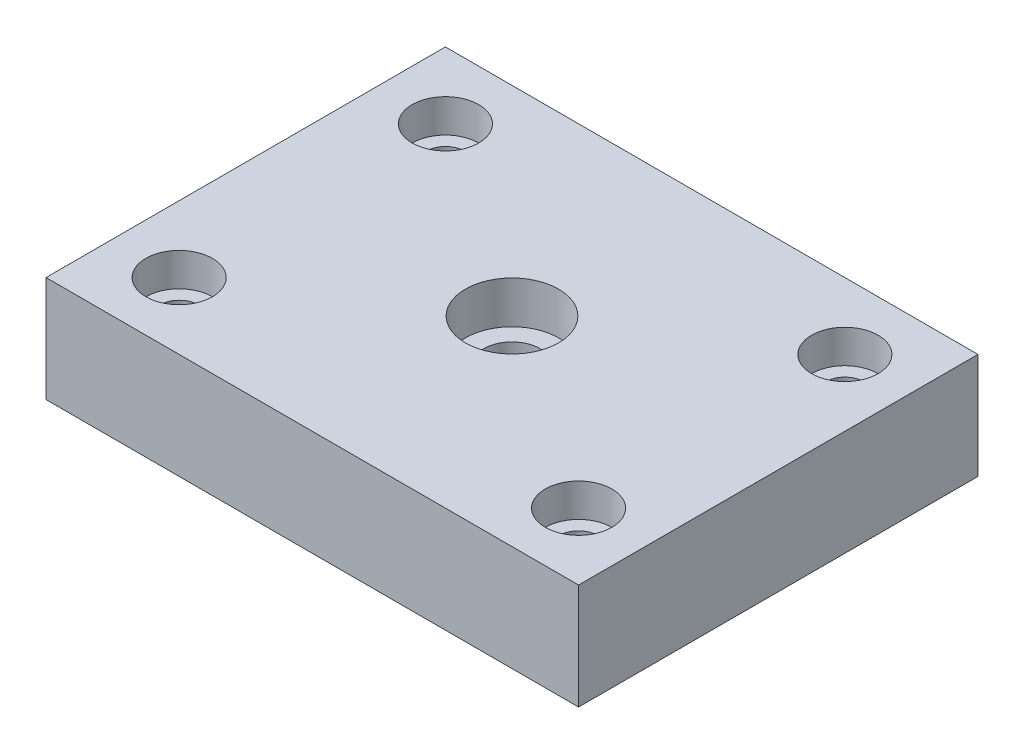
ISO-10303-21;
HEADER;
FILE_DESCRIPTION(('STEP AP214'),'2;1');
FILE_NAME('part.step','',(''),(''),'','','');
FILE_SCHEMA(('AUTOMOTIVE_DESIGN { 1 0 10303 214 1 1 1 1 }'));
ENDSEC;
DATA;
#1=APPLICATION_CONTEXT('core data for automotive mechanical design processes');
#2=APPLICATION_PROTOCOL_DEFINITION('international standard','automotive_design',2000,#1);
#3=PRODUCT_CONTEXT('',#1,'mechanical');
#4=PRODUCT('Part','Part','',(#3));
#5=PRODUCT_RELATED_PRODUCT_CATEGORY('part','',(#4));
#6=PRODUCT_DEFINITION_FORMATION('','',#4);
#7=PRODUCT_DEFINITION_CONTEXT('part definition',#1,'design');
#8=PRODUCT_DEFINITION('design','',#6,#7);
#9=PRODUCT_DEFINITION_SHAPE('','',#8);
#10=(LENGTH_UNIT() NAMED_UNIT(*) SI_UNIT(.MILLI.,.METRE.));
#11=(NAMED_UNIT(*) PLANE_ANGLE_UNIT() SI_UNIT($,.RADIAN.));
#12=(NAMED_UNIT(*) SI_UNIT($,.STERADIAN.) SOLID_ANGLE_UNIT());
#13=UNCERTAINTY_MEASURE_WITH_UNIT(LENGTH_MEASURE(1.E-05),#10,'distance_accuracy_value','');
#14=(GEOMETRIC_REPRESENTATION_CONTEXT(3) GLOBAL_UNCERTAINTY_ASSIGNED_CONTEXT((#13)) GLOBAL_UNIT_ASSIGNED_CONTEXT((#10,
#11,#12)) REPRESENTATION_CONTEXT('',''));
#15=CARTESIAN_POINT('',(0.,0.,0.));
#16=DIRECTION('',(0.,0.,1.));
#17=DIRECTION('',(1.,0.,0.));
#18=AXIS2_PLACEMENT_3D('',#15,#16,#17);
#19=CARTESIAN_POINT('',(40.,-15.875,30.));
#20=DIRECTION('',(1.,0.,0.));
#21=DIRECTION('',(0.,0.,-1.));
#22=AXIS2_PLACEMENT_3D('',#19,#20,#21);
#23=PLANE('',#22);
#24=DIRECTION('',(0.,0.,-1.));
#25=VECTOR('',#24,1.);
#26=CARTESIAN_POINT('',(40.,0.,30.));
#27=LINE('',#26,#25);
#28=CARTESIAN_POINT('',(40.,0.,30.));
#29=VERTEX_POINT('',#28);
#30=CARTESIAN_POINT('',(40.,0.,-30.));
#31=VERTEX_POINT('',#30);
#32=EDGE_CURVE('E103',#29,#31,#27,.T.);
#33=ORIENTED_EDGE('',*,*,#32,.F.);
#34=DIRECTION('',(0.,1.,0.));
#35=VECTOR('',#34,1.);
#36=CARTESIAN_POINT('',(40.,-15.875,30.));
#37=LINE('',#36,#35);
#38=CARTESIAN_POINT('',(40.,-15.875,30.));
#39=VERTEX_POINT('',#38);
#40=EDGE_CURVE('E11',#39,#29,#37,.T.);
#41=ORIENTED_EDGE('',*,*,#40,.F.);
#42=DIRECTION('',(0.,0.,-1.));
#43=VECTOR('',#42,1.);
#44=CARTESIAN_POINT('',(40.,-15.875,30.));
#45=LINE('',#44,#43);
#46=CARTESIAN_POINT('',(40.,-15.875,-30.));
#47=VERTEX_POINT('',#46);
#48=EDGE_CURVE('E96',#39,#47,#45,.T.);
#49=ORIENTED_EDGE('',*,*,#48,.T.);
#50=DIRECTION('',(0.,1.,0.));
#51=VECTOR('',#50,1.);
#52=CARTESIAN_POINT('',(40.,-15.875,-30.));
#53=LINE('',#52,#51);
#54=EDGE_CURVE('E41',#47,#31,#53,.T.);
#55=ORIENTED_EDGE('',*,*,#54,.T.);
#56=EDGE_LOOP('',(#33,#41,#49,#55));
#57=FACE_BOUND('',#56,.T.);
#58=ADVANCED_FACE('F38',(#57),#23,.T.);
#59=CARTESIAN_POINT('',(-40.,-15.875,30.));
#60=DIRECTION('',(0.,0.,1.));
#61=DIRECTION('',(1.,0.,0.));
#62=AXIS2_PLACEMENT_3D('',#59,#60,#61);
#63=PLANE('',#62);
#64=DIRECTION('',(1.,0.,0.));
#65=VECTOR('',#64,1.);
#66=CARTESIAN_POINT('',(-40.,0.,30.));
#67=LINE('',#66,#65);
#68=CARTESIAN_POINT('',(-40.,0.,30.));
#69=VERTEX_POINT('',#68);
#70=EDGE_CURVE('E98',#69,#29,#67,.T.);
#71=ORIENTED_EDGE('',*,*,#70,.F.);
#72=DIRECTION('',(0.,1.,0.));
#73=VECTOR('',#72,1.);
#74=CARTESIAN_POINT('',(-40.,-15.875,30.));
#75=LINE('',#74,#73);
#76=CARTESIAN_POINT('',(-40.,-15.875,30.));
#77=VERTEX_POINT('',#76);
#78=EDGE_CURVE('E47',#77,#69,#75,.T.);
#79=ORIENTED_EDGE('',*,*,#78,.F.);
#80=DIRECTION('',(1.,0.,0.));
#81=VECTOR('',#80,1.);
#82=CARTESIAN_POINT('',(-40.,-15.875,30.));
#83=LINE('',#82,#81);
#84=EDGE_CURVE('E93',#77,#39,#83,.T.);
#85=ORIENTED_EDGE('',*,*,#84,.T.);
#86=ORIENTED_EDGE('',*,*,#40,.T.);
#87=EDGE_LOOP('',(#71,#79,#85,#86));
#88=FACE_BOUND('',#87,.T.);
#89=ADVANCED_FACE('F114',(#88),#63,.T.);
#90=CARTESIAN_POINT('',(-40.,-15.875,30.));
#91=DIRECTION('',(-1.,0.,0.));
#92=DIRECTION('',(0.,0.,1.));
#93=AXIS2_PLACEMENT_3D('',#90,#91,#92);
#94=PLANE('',#93);
#95=DIRECTION('',(0.,0.,1.));
#96=VECTOR('',#95,1.);
#97=CARTESIAN_POINT('',(-40.,0.,30.));
#98=LINE('',#97,#96);
#99=CARTESIAN_POINT('',(-40.,0.,-30.));
#100=VERTEX_POINT('',#99);
#101=EDGE_CURVE('E88',#100,#69,#98,.T.);
#102=ORIENTED_EDGE('',*,*,#101,.F.);
#103=DIRECTION('',(0.,1.,0.));
#104=VECTOR('',#103,1.);
#105=CARTESIAN_POINT('',(-40.,-15.875,-30.));
#106=LINE('',#105,#104);
#107=CARTESIAN_POINT('',(-40.,-15.875,-30.));
#108=VERTEX_POINT('',#107);
#109=EDGE_CURVE('E83',#108,#100,#106,.T.);
#110=ORIENTED_EDGE('',*,*,#109,.F.);
#111=DIRECTION('',(0.,0.,1.));
#112=VECTOR('',#111,1.);
#113=CARTESIAN_POINT('',(-40.,-15.875,30.));
#114=LINE('',#113,#112);
#115=EDGE_CURVE('E86',#108,#77,#114,.T.);
#116=ORIENTED_EDGE('',*,*,#115,.T.);
#117=ORIENTED_EDGE('',*,*,#78,.T.);
#118=EDGE_LOOP('',(#102,#110,#116,#117));
#119=FACE_BOUND('',#118,.T.);
#120=ADVANCED_FACE('F85',(#119),#94,.T.);
#121=CARTESIAN_POINT('',(-40.,-15.875,-30.));
#122=DIRECTION('',(0.,0.,-1.));
#123=DIRECTION('',(-1.,0.,0.));
#124=AXIS2_PLACEMENT_3D('',#121,#122,#123);
#125=PLANE('',#124);
#126=DIRECTION('',(-1.,0.,0.));
#127=VECTOR('',#126,1.);
#128=CARTESIAN_POINT('',(-40.,0.,-30.));
#129=LINE('',#128,#127);
#130=EDGE_CURVE('E106',#31,#100,#129,.T.);
#131=ORIENTED_EDGE('',*,*,#130,.F.);
#132=ORIENTED_EDGE('',*,*,#54,.F.);
#133=DIRECTION('',(-1.,0.,0.));
#134=VECTOR('',#133,1.);
#135=CARTESIAN_POINT('',(-40.,-15.875,-30.));
#136=LINE('',#135,#134);
#137=EDGE_CURVE('E92',#47,#108,#136,.T.);
#138=ORIENTED_EDGE('',*,*,#137,.T.);
#139=ORIENTED_EDGE('',*,*,#109,.T.);
#140=EDGE_LOOP('',(#131,#132,#138,#139));
#141=FACE_BOUND('',#140,.T.);
#142=ADVANCED_FACE('F95',(#141),#125,.T.);
#143=CARTESIAN_POINT('',(0.,-15.875,0.));
#144=DIRECTION('',(0.,-1.,0.));
#145=DIRECTION('',(0.,0.,-1.));
#146=AXIS2_PLACEMENT_3D('',#143,#144,#145);
#147=PLANE('',#146);
#148=CARTESIAN_POINT('',(0.,-15.875,0.));
#149=DIRECTION('',(0.,1.,0.));
#150=DIRECTION('',(0.,0.,1.));
#151=AXIS2_PLACEMENT_3D('',#148,#149,#150);
#152=CIRCLE('',#151,4.2164);
#153=CARTESIAN_POINT('',(0.,-15.875,4.2164));
#154=VERTEX_POINT('',#153);
#155=EDGE_CURVE('E210',#154,#154,#152,.T.);
#156=ORIENTED_EDGE('',*,*,#155,.T.);
#157=EDGE_LOOP('',(#156));
#158=FACE_BOUND('',#157,.T.);
#159=CARTESIAN_POINT('',(-30.,-15.875,20.));
#160=DIRECTION('',(0.,1.,0.));
#161=DIRECTION('',(0.,0.,1.));
#162=AXIS2_PLACEMENT_3D('',#159,#160,#161);
#163=CIRCLE('',#162,2.9);
#164=CARTESIAN_POINT('',(-30.,-15.875,22.9));
#165=VERTEX_POINT('',#164);
#166=EDGE_CURVE('E221',#165,#165,#163,.T.);
#167=ORIENTED_EDGE('',*,*,#166,.T.);
#168=EDGE_LOOP('',(#167));
#169=FACE_BOUND('',#168,.T.);
#170=CARTESIAN_POINT('',(-30.,-15.875,-20.));
#171=DIRECTION('',(0.,1.,0.));
#172=DIRECTION('',(0.,0.,1.));
#173=AXIS2_PLACEMENT_3D('',#170,#171,#172);
#174=CIRCLE('',#173,2.9);
#175=CARTESIAN_POINT('',(-30.,-15.875,-17.1));
#176=VERTEX_POINT('',#175);
#177=EDGE_CURVE('E233',#176,#176,#174,.T.);
#178=ORIENTED_EDGE('',*,*,#177,.T.);
#179=EDGE_LOOP('',(#178));
#180=FACE_BOUND('',#179,.T.);
#181=CARTESIAN_POINT('',(30.,-15.875,-20.));
#182=DIRECTION('',(0.,1.,0.));
#183=DIRECTION('',(0.,0.,1.));
#184=AXIS2_PLACEMENT_3D('',#181,#182,#183);
#185=CIRCLE('',#184,2.89999999999999);
#186=CARTESIAN_POINT('',(30.,-15.875,-17.1));
#187=VERTEX_POINT('',#186);
#188=EDGE_CURVE('E245',#187,#187,#185,.T.);
#189=ORIENTED_EDGE('',*,*,#188,.T.);
#190=EDGE_LOOP('',(#189));
#191=FACE_BOUND('',#190,.T.);
#192=CARTESIAN_POINT('',(30.,-15.875,20.));
#193=DIRECTION('',(0.,1.,0.));
#194=DIRECTION('',(0.,0.,1.));
#195=AXIS2_PLACEMENT_3D('',#192,#193,#194);
#196=CIRCLE('',#195,2.9);
#197=CARTESIAN_POINT('',(30.,-15.875,22.9));
#198=VERTEX_POINT('',#197);
#199=EDGE_CURVE('E107',#198,#198,#196,.T.);
#200=ORIENTED_EDGE('',*,*,#199,.T.);
#201=EDGE_LOOP('',(#200));
#202=FACE_BOUND('',#201,.T.);
#203=ORIENTED_EDGE('',*,*,#48,.F.);
#204=ORIENTED_EDGE('',*,*,#84,.F.);
#205=ORIENTED_EDGE('',*,*,#115,.F.);
#206=ORIENTED_EDGE('',*,*,#137,.F.);
#207=EDGE_LOOP('',(#203,#204,#205,#206));
#208=FACE_BOUND('',#207,.T.);
#209=ADVANCED_FACE('F91',(#158,#169,#180,#191,#202,#208),#147,.T.);
#210=CARTESIAN_POINT('',(0.,0.,0.));
#211=DIRECTION('',(0.,-1.,0.));
#212=DIRECTION('',(0.,0.,-1.));
#213=AXIS2_PLACEMENT_3D('',#210,#211,#212);
#214=PLANE('',#213);
#215=CARTESIAN_POINT('',(0.,0.,0.));
#216=DIRECTION('',(0.,1.,0.));
#217=DIRECTION('',(0.,0.,1.));
#218=AXIS2_PLACEMENT_3D('',#215,#216,#217);
#219=CIRCLE('',#218,7.);
#220=CARTESIAN_POINT('',(0.,0.,7.));
#221=VERTEX_POINT('',#220);
#222=EDGE_CURVE('E203',#221,#221,#219,.T.);
#223=ORIENTED_EDGE('',*,*,#222,.F.);
#224=EDGE_LOOP('',(#223));
#225=FACE_BOUND('',#224,.T.);
#226=CARTESIAN_POINT('',(-30.,0.,20.));
#227=DIRECTION('',(0.,1.,0.));
#228=DIRECTION('',(0.,0.,1.));
#229=AXIS2_PLACEMENT_3D('',#226,#227,#228);
#230=CIRCLE('',#229,5.);
#231=CARTESIAN_POINT('',(-30.,0.,25.));
#232=VERTEX_POINT('',#231);
#233=EDGE_CURVE('E212',#232,#232,#230,.T.);
#234=ORIENTED_EDGE('',*,*,#233,.F.);
#235=EDGE_LOOP('',(#234));
#236=FACE_BOUND('',#235,.T.);
#237=CARTESIAN_POINT('',(-30.,0.,-20.));
#238=DIRECTION('',(0.,1.,0.));
#239=DIRECTION('',(0.,0.,1.));
#240=AXIS2_PLACEMENT_3D('',#237,#238,#239);
#241=CIRCLE('',#240,5.);
#242=CARTESIAN_POINT('',(-30.,0.,-15.));
#243=VERTEX_POINT('',#242);
#244=EDGE_CURVE('E224',#243,#243,#241,.T.);
#245=ORIENTED_EDGE('',*,*,#244,.F.);
#246=EDGE_LOOP('',(#245));
#247=FACE_BOUND('',#246,.T.);
#248=CARTESIAN_POINT('',(30.,0.,-20.));
#249=DIRECTION('',(0.,1.,0.));
#250=DIRECTION('',(0.,0.,1.));
#251=AXIS2_PLACEMENT_3D('',#248,#249,#250);
#252=CIRCLE('',#251,5.);
#253=CARTESIAN_POINT('',(30.,0.,-15.));
#254=VERTEX_POINT('',#253);
#255=EDGE_CURVE('E236',#254,#254,#252,.T.);
#256=ORIENTED_EDGE('',*,*,#255,.F.);
#257=EDGE_LOOP('',(#256));
#258=FACE_BOUND('',#257,.T.);
#259=CARTESIAN_POINT('',(30.,0.,20.));
#260=DIRECTION('',(0.,1.,0.));
#261=DIRECTION('',(0.,0.,1.));
#262=AXIS2_PLACEMENT_3D('',#259,#260,#261);
#263=CIRCLE('',#262,5.);
#264=CARTESIAN_POINT('',(30.,0.,25.));
#265=VERTEX_POINT('',#264);
#266=EDGE_CURVE('E248',#265,#265,#263,.T.);
#267=ORIENTED_EDGE('',*,*,#266,.F.);
#268=EDGE_LOOP('',(#267));
#269=FACE_BOUND('',#268,.T.);
#270=ORIENTED_EDGE('',*,*,#32,.T.);
#271=ORIENTED_EDGE('',*,*,#130,.T.);
#272=ORIENTED_EDGE('',*,*,#101,.T.);
#273=ORIENTED_EDGE('',*,*,#70,.T.);
#274=EDGE_LOOP('',(#270,#271,#272,#273));
#275=FACE_BOUND('',#274,.T.);
#276=ADVANCED_FACE('F113',(#225,#236,#247,#258,#269,#275),#214,.F.);
#277=CARTESIAN_POINT('',(30.,0.,20.));
#278=DIRECTION('',(0.,1.,0.));
#279=DIRECTION('',(0.,0.,1.));
#280=AXIS2_PLACEMENT_3D('',#277,#278,#279);
#281=CYLINDRICAL_SURFACE('',#280,2.9);
#282=ORIENTED_EDGE('',*,*,#199,.F.);
#283=EDGE_LOOP('',(#282));
#284=FACE_BOUND('',#283,.T.);
#285=CARTESIAN_POINT('',(30.,-5.,20.));
#286=DIRECTION('',(0.,1.,0.));
#287=DIRECTION('',(0.,0.,1.));
#288=AXIS2_PLACEMENT_3D('',#285,#286,#287);
#289=CIRCLE('',#288,2.9);
#290=CARTESIAN_POINT('',(30.,-5.,22.9));
#291=VERTEX_POINT('',#290);
#292=EDGE_CURVE('E254',#291,#291,#289,.T.);
#293=ORIENTED_EDGE('',*,*,#292,.T.);
#294=EDGE_LOOP('',(#293));
#295=FACE_BOUND('',#294,.T.);
#296=ADVANCED_FACE('F132',(#284,#295),#281,.F.);
#297=CARTESIAN_POINT('',(32.9,-5.,20.));
#298=DIRECTION('',(0.,-1.,0.));
#299=DIRECTION('',(0.,0.,-1.));
#300=AXIS2_PLACEMENT_3D('',#297,#298,#299);
#301=PLANE('',#300);
#302=ORIENTED_EDGE('',*,*,#292,.F.);
#303=EDGE_LOOP('',(#302));
#304=FACE_BOUND('',#303,.T.);
#305=CARTESIAN_POINT('',(30.,-5.,20.));
#306=DIRECTION('',(0.,1.,0.));
#307=DIRECTION('',(0.,0.,1.));
#308=AXIS2_PLACEMENT_3D('',#305,#306,#307);
#309=CIRCLE('',#308,5.);
#310=CARTESIAN_POINT('',(30.,-5.,25.));
#311=VERTEX_POINT('',#310);
#312=EDGE_CURVE('E251',#311,#311,#309,.T.);
#313=ORIENTED_EDGE('',*,*,#312,.T.);
#314=EDGE_LOOP('',(#313));
#315=FACE_BOUND('',#314,.T.);
#316=ADVANCED_FACE('F139',(#304,#315),#301,.F.);
#317=CARTESIAN_POINT('',(30.,0.,20.));
#318=DIRECTION('',(0.,1.,0.));
#319=DIRECTION('',(0.,0.,1.));
#320=AXIS2_PLACEMENT_3D('',#317,#318,#319);
#321=CYLINDRICAL_SURFACE('',#320,5.);
#322=ORIENTED_EDGE('',*,*,#312,.F.);
#323=EDGE_LOOP('',(#322));
#324=FACE_BOUND('',#323,.T.);
#325=ORIENTED_EDGE('',*,*,#266,.T.);
#326=EDGE_LOOP('',(#325));
#327=FACE_BOUND('',#326,.T.);
#328=ADVANCED_FACE('F143',(#324,#327),#321,.F.);
#329=CARTESIAN_POINT('',(30.,0.,-20.));
#330=DIRECTION('',(0.,1.,0.));
#331=DIRECTION('',(0.,0.,1.));
#332=AXIS2_PLACEMENT_3D('',#329,#330,#331);
#333=CYLINDRICAL_SURFACE('',#332,2.9);
#334=ORIENTED_EDGE('',*,*,#188,.F.);
#335=EDGE_LOOP('',(#334));
#336=FACE_BOUND('',#335,.T.);
#337=CARTESIAN_POINT('',(30.,-5.,-20.));
#338=DIRECTION('',(0.,1.,0.));
#339=DIRECTION('',(0.,0.,1.));
#340=AXIS2_PLACEMENT_3D('',#337,#338,#339);
#341=CIRCLE('',#340,2.9);
#342=CARTESIAN_POINT('',(30.,-5.,-17.1));
#343=VERTEX_POINT('',#342);
#344=EDGE_CURVE('E242',#343,#343,#341,.T.);
#345=ORIENTED_EDGE('',*,*,#344,.T.);
#346=EDGE_LOOP('',(#345));
#347=FACE_BOUND('',#346,.T.);
#348=ADVANCED_FACE('F147',(#336,#347),#333,.F.);
#349=CARTESIAN_POINT('',(32.9,-5.,-20.));
#350=DIRECTION('',(0.,-1.,0.));
#351=DIRECTION('',(0.,0.,-1.));
#352=AXIS2_PLACEMENT_3D('',#349,#350,#351);
#353=PLANE('',#352);
#354=ORIENTED_EDGE('',*,*,#344,.F.);
#355=EDGE_LOOP('',(#354));
#356=FACE_BOUND('',#355,.T.);
#357=CARTESIAN_POINT('',(30.,-5.,-20.));
#358=DIRECTION('',(0.,1.,0.));
#359=DIRECTION('',(0.,0.,1.));
#360=AXIS2_PLACEMENT_3D('',#357,#358,#359);
#361=CIRCLE('',#360,5.);
#362=CARTESIAN_POINT('',(30.,-5.,-15.));
#363=VERTEX_POINT('',#362);
#364=EDGE_CURVE('E239',#363,#363,#361,.T.);
#365=ORIENTED_EDGE('',*,*,#364,.T.);
#366=EDGE_LOOP('',(#365));
#367=FACE_BOUND('',#366,.T.);
#368=ADVANCED_FACE('F151',(#356,#367),#353,.F.);
#369=CARTESIAN_POINT('',(30.,0.,-20.));
#370=DIRECTION('',(0.,1.,0.));
#371=DIRECTION('',(0.,0.,1.));
#372=AXIS2_PLACEMENT_3D('',#369,#370,#371);
#373=CYLINDRICAL_SURFACE('',#372,5.);
#374=ORIENTED_EDGE('',*,*,#364,.F.);
#375=EDGE_LOOP('',(#374));
#376=FACE_BOUND('',#375,.T.);
#377=ORIENTED_EDGE('',*,*,#255,.T.);
#378=EDGE_LOOP('',(#377));
#379=FACE_BOUND('',#378,.T.);
#380=ADVANCED_FACE('F155',(#376,#379),#373,.F.);
#381=CARTESIAN_POINT('',(-30.,0.,-20.));
#382=DIRECTION('',(0.,1.,0.));
#383=DIRECTION('',(0.,0.,1.));
#384=AXIS2_PLACEMENT_3D('',#381,#382,#383);
#385=CYLINDRICAL_SURFACE('',#384,2.9);
#386=ORIENTED_EDGE('',*,*,#177,.F.);
#387=EDGE_LOOP('',(#386));
#388=FACE_BOUND('',#387,.T.);
#389=CARTESIAN_POINT('',(-30.,-5.,-20.));
#390=DIRECTION('',(0.,1.,0.));
#391=DIRECTION('',(0.,0.,1.));
#392=AXIS2_PLACEMENT_3D('',#389,#390,#391);
#393=CIRCLE('',#392,2.9);
#394=CARTESIAN_POINT('',(-30.,-5.,-17.1));
#395=VERTEX_POINT('',#394);
#396=EDGE_CURVE('E230',#395,#395,#393,.T.);
#397=ORIENTED_EDGE('',*,*,#396,.T.);
#398=EDGE_LOOP('',(#397));
#399=FACE_BOUND('',#398,.T.);
#400=ADVANCED_FACE('F159',(#388,#399),#385,.F.);
#401=CARTESIAN_POINT('',(-27.1,-5.,-20.));
#402=DIRECTION('',(0.,-1.,0.));
#403=DIRECTION('',(0.,0.,-1.));
#404=AXIS2_PLACEMENT_3D('',#401,#402,#403);
#405=PLANE('',#404);
#406=ORIENTED_EDGE('',*,*,#396,.F.);
#407=EDGE_LOOP('',(#406));
#408=FACE_BOUND('',#407,.T.);
#409=CARTESIAN_POINT('',(-30.,-5.,-20.));
#410=DIRECTION('',(0.,1.,0.));
#411=DIRECTION('',(0.,0.,1.));
#412=AXIS2_PLACEMENT_3D('',#409,#410,#411);
#413=CIRCLE('',#412,5.);
#414=CARTESIAN_POINT('',(-30.,-5.,-15.));
#415=VERTEX_POINT('',#414);
#416=EDGE_CURVE('E227',#415,#415,#413,.T.);
#417=ORIENTED_EDGE('',*,*,#416,.T.);
#418=EDGE_LOOP('',(#417));
#419=FACE_BOUND('',#418,.T.);
#420=ADVANCED_FACE('F163',(#408,#419),#405,.F.);
#421=CARTESIAN_POINT('',(-30.,0.,-20.));
#422=DIRECTION('',(0.,1.,0.));
#423=DIRECTION('',(0.,0.,1.));
#424=AXIS2_PLACEMENT_3D('',#421,#422,#423);
#425=CYLINDRICAL_SURFACE('',#424,5.);
#426=ORIENTED_EDGE('',*,*,#416,.F.);
#427=EDGE_LOOP('',(#426));
#428=FACE_BOUND('',#427,.T.);
#429=ORIENTED_EDGE('',*,*,#244,.T.);
#430=EDGE_LOOP('',(#429));
#431=FACE_BOUND('',#430,.T.);
#432=ADVANCED_FACE('F167',(#428,#431),#425,.F.);
#433=CARTESIAN_POINT('',(-30.,0.,20.));
#434=DIRECTION('',(0.,1.,0.));
#435=DIRECTION('',(0.,0.,1.));
#436=AXIS2_PLACEMENT_3D('',#433,#434,#435);
#437=CYLINDRICAL_SURFACE('',#436,2.9);
#438=ORIENTED_EDGE('',*,*,#166,.F.);
#439=EDGE_LOOP('',(#438));
#440=FACE_BOUND('',#439,.T.);
#441=CARTESIAN_POINT('',(-30.,-5.,20.));
#442=DIRECTION('',(0.,1.,0.));
#443=DIRECTION('',(0.,0.,1.));
#444=AXIS2_PLACEMENT_3D('',#441,#442,#443);
#445=CIRCLE('',#444,2.9);
#446=CARTESIAN_POINT('',(-30.,-5.,22.9));
#447=VERTEX_POINT('',#446);
#448=EDGE_CURVE('E218',#447,#447,#445,.T.);
#449=ORIENTED_EDGE('',*,*,#448,.T.);
#450=EDGE_LOOP('',(#449));
#451=FACE_BOUND('',#450,.T.);
#452=ADVANCED_FACE('F171',(#440,#451),#437,.F.);
#453=CARTESIAN_POINT('',(-27.1,-5.,20.));
#454=DIRECTION('',(0.,-1.,0.));
#455=DIRECTION('',(0.,0.,-1.));
#456=AXIS2_PLACEMENT_3D('',#453,#454,#455);
#457=PLANE('',#456);
#458=ORIENTED_EDGE('',*,*,#448,.F.);
#459=EDGE_LOOP('',(#458));
#460=FACE_BOUND('',#459,.T.);
#461=CARTESIAN_POINT('',(-30.,-5.,20.));
#462=DIRECTION('',(0.,1.,0.));
#463=DIRECTION('',(0.,0.,1.));
#464=AXIS2_PLACEMENT_3D('',#461,#462,#463);
#465=CIRCLE('',#464,5.);
#466=CARTESIAN_POINT('',(-30.,-5.,25.));
#467=VERTEX_POINT('',#466);
#468=EDGE_CURVE('E215',#467,#467,#465,.T.);
#469=ORIENTED_EDGE('',*,*,#468,.T.);
#470=EDGE_LOOP('',(#469));
#471=FACE_BOUND('',#470,.T.);
#472=ADVANCED_FACE('F175',(#460,#471),#457,.F.);
#473=CARTESIAN_POINT('',(-30.,0.,20.));
#474=DIRECTION('',(0.,1.,0.));
#475=DIRECTION('',(0.,0.,1.));
#476=AXIS2_PLACEMENT_3D('',#473,#474,#475);
#477=CYLINDRICAL_SURFACE('',#476,5.);
#478=ORIENTED_EDGE('',*,*,#468,.F.);
#479=EDGE_LOOP('',(#478));
#480=FACE_BOUND('',#479,.T.);
#481=ORIENTED_EDGE('',*,*,#233,.T.);
#482=EDGE_LOOP('',(#481));
#483=FACE_BOUND('',#482,.T.);
#484=ADVANCED_FACE('F179',(#480,#483),#477,.F.);
#485=CARTESIAN_POINT('',(0.,0.,0.));
#486=DIRECTION('',(0.,1.,0.));
#487=DIRECTION('',(0.,0.,1.));
#488=AXIS2_PLACEMENT_3D('',#485,#486,#487);
#489=CYLINDRICAL_SURFACE('',#488,4.2164);
#490=ORIENTED_EDGE('',*,*,#155,.F.);
#491=EDGE_LOOP('',(#490));
#492=FACE_BOUND('',#491,.T.);
#493=CARTESIAN_POINT('',(0.,-6.35,0.));
#494=DIRECTION('',(0.,1.,0.));
#495=DIRECTION('',(0.,0.,1.));
#496=AXIS2_PLACEMENT_3D('',#493,#494,#495);
#497=CIRCLE('',#496,4.2164);
#498=CARTESIAN_POINT('',(0.,-6.35,4.2164));
#499=VERTEX_POINT('',#498);
#500=EDGE_CURVE('E205',#499,#499,#497,.T.);
#501=ORIENTED_EDGE('',*,*,#500,.T.);
#502=EDGE_LOOP('',(#501));
#503=FACE_BOUND('',#502,.T.);
#504=ADVANCED_FACE('F183',(#492,#503),#489,.F.);
#505=CARTESIAN_POINT('',(4.2164,-6.35,0.));
#506=DIRECTION('',(0.,-1.,0.));
#507=DIRECTION('',(0.,0.,-1.));
#508=AXIS2_PLACEMENT_3D('',#505,#506,#507);
#509=PLANE('',#508);
#510=ORIENTED_EDGE('',*,*,#500,.F.);
#511=EDGE_LOOP('',(#510));
#512=FACE_BOUND('',#511,.T.);
#513=CARTESIAN_POINT('',(0.,-6.35,0.));
#514=DIRECTION('',(0.,1.,0.));
#515=DIRECTION('',(0.,0.,1.));
#516=AXIS2_PLACEMENT_3D('',#513,#514,#515);
#517=CIRCLE('',#516,7.);
#518=CARTESIAN_POINT('',(0.,-6.35,7.));
#519=VERTEX_POINT('',#518);
#520=EDGE_CURVE('E200',#519,#519,#517,.T.);
#521=ORIENTED_EDGE('',*,*,#520,.T.);
#522=EDGE_LOOP('',(#521));
#523=FACE_BOUND('',#522,.T.);
#524=ADVANCED_FACE('F187',(#512,#523),#509,.F.);
#525=CARTESIAN_POINT('',(0.,0.,0.));
#526=DIRECTION('',(0.,1.,0.));
#527=DIRECTION('',(0.,0.,1.));
#528=AXIS2_PLACEMENT_3D('',#525,#526,#527);
#529=CYLINDRICAL_SURFACE('',#528,7.);
#530=ORIENTED_EDGE('',*,*,#520,.F.);
#531=EDGE_LOOP('',(#530));
#532=FACE_BOUND('',#531,.T.);
#533=ORIENTED_EDGE('',*,*,#222,.T.);
#534=EDGE_LOOP('',(#533));
#535=FACE_BOUND('',#534,.T.);
#536=ADVANCED_FACE('F191',(#532,#535),#529,.F.);
#537=CLOSED_SHELL('',(#58,#89,#120,#142,#209,#276,#296,#316,#328,#348,#368,#380,#400,#420,#432,
#452,#472,#484,#504,#524,#536));
#538=MANIFOLD_SOLID_BREP('B2',#537);
#539=ADVANCED_BREP_SHAPE_REPRESENTATION('',(#18,#538),#14);
#540=SHAPE_DEFINITION_REPRESENTATION(#9,#539);
ENDSEC;
END-ISO-10303-21;
